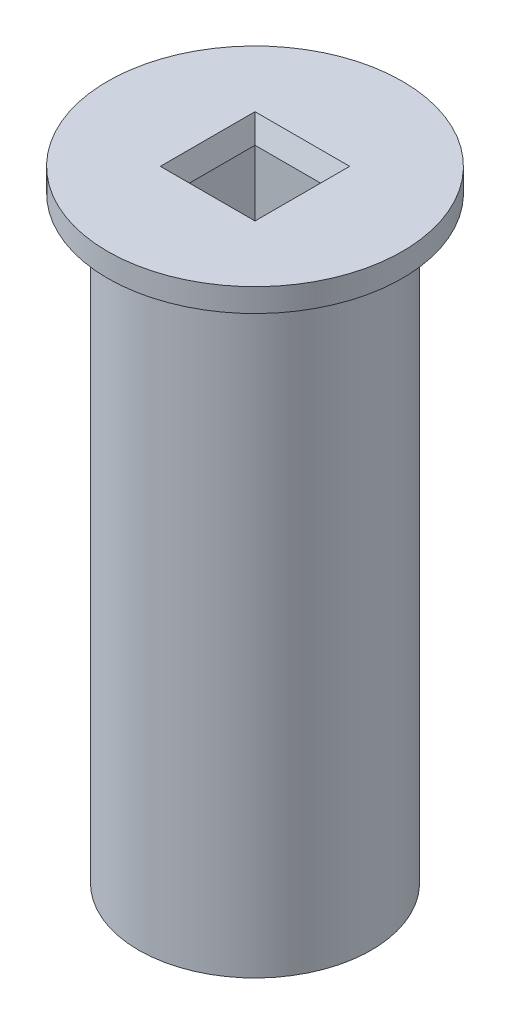
ISO-10303-21;
HEADER;
FILE_DESCRIPTION(('STEP AP214'),'2;1');
FILE_NAME('part.step','',(''),(''),'','','');
FILE_SCHEMA(('AUTOMOTIVE_DESIGN { 1 0 10303 214 1 1 1 1 }'));
ENDSEC;
DATA;
#1=APPLICATION_CONTEXT('core data for automotive mechanical design processes');
#2=APPLICATION_PROTOCOL_DEFINITION('international standard','automotive_design',2000,#1);
#3=PRODUCT_CONTEXT('',#1,'mechanical');
#4=PRODUCT('Part','Part','',(#3));
#5=PRODUCT_RELATED_PRODUCT_CATEGORY('part','',(#4));
#6=PRODUCT_DEFINITION_FORMATION('','',#4);
#7=PRODUCT_DEFINITION_CONTEXT('part definition',#1,'design');
#8=PRODUCT_DEFINITION('design','',#6,#7);
#9=PRODUCT_DEFINITION_SHAPE('','',#8);
#10=(LENGTH_UNIT() NAMED_UNIT(*) SI_UNIT(.MILLI.,.METRE.));
#11=(NAMED_UNIT(*) PLANE_ANGLE_UNIT() SI_UNIT($,.RADIAN.));
#12=(NAMED_UNIT(*) SI_UNIT($,.STERADIAN.) SOLID_ANGLE_UNIT());
#13=UNCERTAINTY_MEASURE_WITH_UNIT(LENGTH_MEASURE(1.E-05),#10,'distance_accuracy_value','');
#14=(GEOMETRIC_REPRESENTATION_CONTEXT(3) GLOBAL_UNCERTAINTY_ASSIGNED_CONTEXT((#13)) GLOBAL_UNIT_ASSIGNED_CONTEXT((#10,
#11,#12)) REPRESENTATION_CONTEXT('',''));
#15=CARTESIAN_POINT('',(0.,0.,0.));
#16=DIRECTION('',(0.,0.,1.));
#17=DIRECTION('',(1.,0.,0.));
#18=AXIS2_PLACEMENT_3D('',#15,#16,#17);
#19=CARTESIAN_POINT('',(0.,80.,0.));
#20=DIRECTION('',(0.,-1.,0.));
#21=DIRECTION('',(0.,0.,-1.));
#22=AXIS2_PLACEMENT_3D('',#19,#20,#21);
#23=CYLINDRICAL_SURFACE('',#22,15.);
#24=CARTESIAN_POINT('',(0.,0.,0.));
#25=DIRECTION('',(0.,1.,0.));
#26=DIRECTION('',(0.,0.,1.));
#27=AXIS2_PLACEMENT_3D('',#24,#25,#26);
#28=CIRCLE('',#27,15.);
#29=CARTESIAN_POINT('',(0.,0.,15.));
#30=VERTEX_POINT('',#29);
#31=EDGE_CURVE('E92',#30,#30,#28,.T.);
#32=ORIENTED_EDGE('',*,*,#31,.T.);
#33=EDGE_LOOP('',(#32));
#34=FACE_BOUND('',#33,.T.);
#35=CARTESIAN_POINT('',(0.,77.,0.));
#36=DIRECTION('',(0.,1.,0.));
#37=DIRECTION('',(0.,0.,1.));
#38=AXIS2_PLACEMENT_3D('',#35,#36,#37);
#39=CIRCLE('',#38,15.);
#40=CARTESIAN_POINT('',(0.,77.,15.));
#41=VERTEX_POINT('',#40);
#42=EDGE_CURVE('E113',#41,#41,#39,.T.);
#43=ORIENTED_EDGE('',*,*,#42,.F.);
#44=EDGE_LOOP('',(#43));
#45=FACE_BOUND('',#44,.T.);
#46=ADVANCED_FACE('F33',(#34,#45),#23,.T.);
#47=CARTESIAN_POINT('',(0.,80.,0.));
#48=DIRECTION('',(0.,1.,0.));
#49=DIRECTION('',(0.,0.,1.));
#50=AXIS2_PLACEMENT_3D('',#47,#48,#49);
#51=PLANE('',#50);
#52=DIRECTION('',(1.,0.,0.));
#53=VECTOR('',#52,1.);
#54=CARTESIAN_POINT('',(0.,80.,-6.1));
#55=LINE('',#54,#53);
#56=CARTESIAN_POINT('',(-6.1,80.,-6.1));
#57=VERTEX_POINT('',#56);
#58=CARTESIAN_POINT('',(6.1,80.,-6.1));
#59=VERTEX_POINT('',#58);
#60=EDGE_CURVE('E128',#57,#59,#55,.T.);
#61=ORIENTED_EDGE('',*,*,#60,.T.);
#62=DIRECTION('',(0.,0.,1.));
#63=VECTOR('',#62,1.);
#64=CARTESIAN_POINT('',(6.1,80.,0.));
#65=LINE('',#64,#63);
#66=CARTESIAN_POINT('',(6.1,80.,6.1));
#67=VERTEX_POINT('',#66);
#68=EDGE_CURVE('E134',#59,#67,#65,.T.);
#69=ORIENTED_EDGE('',*,*,#68,.T.);
#70=DIRECTION('',(-1.,0.,0.));
#71=VECTOR('',#70,1.);
#72=CARTESIAN_POINT('',(0.,80.,6.1));
#73=LINE('',#72,#71);
#74=CARTESIAN_POINT('',(-6.1,80.,6.1));
#75=VERTEX_POINT('',#74);
#76=EDGE_CURVE('E132',#67,#75,#73,.T.);
#77=ORIENTED_EDGE('',*,*,#76,.T.);
#78=DIRECTION('',(0.,0.,-1.));
#79=VECTOR('',#78,1.);
#80=CARTESIAN_POINT('',(-6.1,80.,0.));
#81=LINE('',#80,#79);
#82=EDGE_CURVE('E130',#75,#57,#81,.T.);
#83=ORIENTED_EDGE('',*,*,#82,.T.);
#84=EDGE_LOOP('',(#61,#69,#77,#83));
#85=FACE_BOUND('',#84,.T.);
#86=CARTESIAN_POINT('',(0.,80.,0.));
#87=DIRECTION('',(0.,1.,0.));
#88=DIRECTION('',(0.,0.,1.));
#89=AXIS2_PLACEMENT_3D('',#86,#87,#88);
#90=CIRCLE('',#89,19.);
#91=CARTESIAN_POINT('',(0.,80.,19.));
#92=VERTEX_POINT('',#91);
#93=EDGE_CURVE('E110',#92,#92,#90,.T.);
#94=ORIENTED_EDGE('',*,*,#93,.T.);
#95=EDGE_LOOP('',(#94));
#96=FACE_BOUND('',#95,.T.);
#97=ADVANCED_FACE('F155',(#85,#96),#51,.T.);
#98=CARTESIAN_POINT('',(0.,0.,0.));
#99=DIRECTION('',(0.,1.,0.));
#100=DIRECTION('',(0.,0.,1.));
#101=AXIS2_PLACEMENT_3D('',#98,#99,#100);
#102=PLANE('',#101);
#103=ORIENTED_EDGE('',*,*,#31,.F.);
#104=EDGE_LOOP('',(#103));
#105=FACE_BOUND('',#104,.T.);
#106=DIRECTION('',(0.,0.,1.));
#107=VECTOR('',#106,1.);
#108=CARTESIAN_POINT('',(-5.1,0.,5.1));
#109=LINE('',#108,#107);
#110=CARTESIAN_POINT('',(-5.1,0.,-5.1));
#111=VERTEX_POINT('',#110);
#112=CARTESIAN_POINT('',(-5.1,0.,5.1));
#113=VERTEX_POINT('',#112);
#114=EDGE_CURVE('E88',#111,#113,#109,.T.);
#115=ORIENTED_EDGE('',*,*,#114,.T.);
#116=DIRECTION('',(1.,0.,0.));
#117=VECTOR('',#116,1.);
#118=CARTESIAN_POINT('',(5.1,0.,5.1));
#119=LINE('',#118,#117);
#120=CARTESIAN_POINT('',(5.1,0.,5.1));
#121=VERTEX_POINT('',#120);
#122=EDGE_CURVE('E96',#113,#121,#119,.T.);
#123=ORIENTED_EDGE('',*,*,#122,.T.);
#124=DIRECTION('',(0.,0.,-1.));
#125=VECTOR('',#124,1.);
#126=CARTESIAN_POINT('',(5.1,0.,5.1));
#127=LINE('',#126,#125);
#128=CARTESIAN_POINT('',(5.1,0.,-5.1));
#129=VERTEX_POINT('',#128);
#130=EDGE_CURVE('E102',#121,#129,#127,.T.);
#131=ORIENTED_EDGE('',*,*,#130,.T.);
#132=DIRECTION('',(-1.,0.,0.));
#133=VECTOR('',#132,1.);
#134=CARTESIAN_POINT('',(5.1,0.,-5.1));
#135=LINE('',#134,#133);
#136=EDGE_CURVE('E106',#129,#111,#135,.T.);
#137=ORIENTED_EDGE('',*,*,#136,.T.);
#138=EDGE_LOOP('',(#115,#123,#131,#137));
#139=FACE_BOUND('',#138,.T.);
#140=ADVANCED_FACE('F104',(#105,#139),#102,.F.);
#141=CARTESIAN_POINT('',(-5.1,80.,5.1));
#142=DIRECTION('',(1.,0.,0.));
#143=DIRECTION('',(0.,0.,-1.));
#144=AXIS2_PLACEMENT_3D('',#141,#142,#143);
#145=PLANE('',#144);
#146=DIRECTION('',(0.,-1.,0.));
#147=VECTOR('',#146,1.);
#148=CARTESIAN_POINT('',(-5.1,80.,-5.1));
#149=LINE('',#148,#147);
#150=CARTESIAN_POINT('',(-5.1,77.2525225805453,-5.1));
#151=VERTEX_POINT('',#150);
#152=EDGE_CURVE('E118',#151,#111,#149,.T.);
#153=ORIENTED_EDGE('',*,*,#152,.F.);
#154=DIRECTION('',(0.,0.,1.));
#155=VECTOR('',#154,1.);
#156=CARTESIAN_POINT('',(-5.1,77.2525225805453,5.1));
#157=LINE('',#156,#155);
#158=CARTESIAN_POINT('',(-5.1,77.2525225805453,5.1));
#159=VERTEX_POINT('',#158);
#160=EDGE_CURVE('E42',#151,#159,#157,.T.);
#161=ORIENTED_EDGE('',*,*,#160,.T.);
#162=DIRECTION('',(0.,-1.,0.));
#163=VECTOR('',#162,1.);
#164=CARTESIAN_POINT('',(-5.1,80.,5.1));
#165=LINE('',#164,#163);
#166=EDGE_CURVE('E84',#159,#113,#165,.T.);
#167=ORIENTED_EDGE('',*,*,#166,.T.);
#168=ORIENTED_EDGE('',*,*,#114,.F.);
#169=EDGE_LOOP('',(#153,#161,#167,#168));
#170=FACE_BOUND('',#169,.T.);
#171=ADVANCED_FACE('F86',(#170),#145,.T.);
#172=CARTESIAN_POINT('',(5.1,80.,5.1));
#173=DIRECTION('',(0.,0.,-1.));
#174=DIRECTION('',(-1.,0.,0.));
#175=AXIS2_PLACEMENT_3D('',#172,#173,#174);
#176=PLANE('',#175);
#177=ORIENTED_EDGE('',*,*,#166,.F.);
#178=DIRECTION('',(1.,0.,0.));
#179=VECTOR('',#178,1.);
#180=CARTESIAN_POINT('',(5.1,77.2525225805453,5.1));
#181=LINE('',#180,#179);
#182=CARTESIAN_POINT('',(5.1,77.2525225805453,5.1));
#183=VERTEX_POINT('',#182);
#184=EDGE_CURVE('E137',#159,#183,#181,.T.);
#185=ORIENTED_EDGE('',*,*,#184,.T.);
#186=DIRECTION('',(0.,-1.,0.));
#187=VECTOR('',#186,1.);
#188=CARTESIAN_POINT('',(5.1,80.,5.1));
#189=LINE('',#188,#187);
#190=EDGE_CURVE('E93',#183,#121,#189,.T.);
#191=ORIENTED_EDGE('',*,*,#190,.T.);
#192=ORIENTED_EDGE('',*,*,#122,.F.);
#193=EDGE_LOOP('',(#177,#185,#191,#192));
#194=FACE_BOUND('',#193,.T.);
#195=ADVANCED_FACE('F97',(#194),#176,.T.);
#196=CARTESIAN_POINT('',(5.1,80.,5.1));
#197=DIRECTION('',(-1.,0.,0.));
#198=DIRECTION('',(0.,0.,1.));
#199=AXIS2_PLACEMENT_3D('',#196,#197,#198);
#200=PLANE('',#199);
#201=ORIENTED_EDGE('',*,*,#190,.F.);
#202=DIRECTION('',(0.,0.,-1.));
#203=VECTOR('',#202,1.);
#204=CARTESIAN_POINT('',(5.1,77.2525225805453,5.1));
#205=LINE('',#204,#203);
#206=CARTESIAN_POINT('',(5.1,77.2525225805453,-5.1));
#207=VERTEX_POINT('',#206);
#208=EDGE_CURVE('E125',#183,#207,#205,.T.);
#209=ORIENTED_EDGE('',*,*,#208,.T.);
#210=DIRECTION('',(0.,-1.,0.));
#211=VECTOR('',#210,1.);
#212=CARTESIAN_POINT('',(5.1,80.,-5.1));
#213=LINE('',#212,#211);
#214=EDGE_CURVE('E120',#207,#129,#213,.T.);
#215=ORIENTED_EDGE('',*,*,#214,.T.);
#216=ORIENTED_EDGE('',*,*,#130,.F.);
#217=EDGE_LOOP('',(#201,#209,#215,#216));
#218=FACE_BOUND('',#217,.T.);
#219=ADVANCED_FACE('F244',(#218),#200,.T.);
#220=CARTESIAN_POINT('',(5.1,80.,-5.1));
#221=DIRECTION('',(0.,0.,1.));
#222=DIRECTION('',(1.,0.,0.));
#223=AXIS2_PLACEMENT_3D('',#220,#221,#222);
#224=PLANE('',#223);
#225=ORIENTED_EDGE('',*,*,#214,.F.);
#226=DIRECTION('',(-1.,0.,0.));
#227=VECTOR('',#226,1.);
#228=CARTESIAN_POINT('',(5.1,77.2525225805453,-5.1));
#229=LINE('',#228,#227);
#230=EDGE_CURVE('E11',#207,#151,#229,.T.);
#231=ORIENTED_EDGE('',*,*,#230,.T.);
#232=ORIENTED_EDGE('',*,*,#152,.T.);
#233=ORIENTED_EDGE('',*,*,#136,.F.);
#234=EDGE_LOOP('',(#225,#231,#232,#233));
#235=FACE_BOUND('',#234,.T.);
#236=ADVANCED_FACE('F168',(#235),#224,.T.);
#237=CARTESIAN_POINT('',(0.,77.,0.));
#238=DIRECTION('',(0.,1.,0.));
#239=DIRECTION('',(0.,0.,1.));
#240=AXIS2_PLACEMENT_3D('',#237,#238,#239);
#241=PLANE('',#240);
#242=CARTESIAN_POINT('',(0.,77.,0.));
#243=DIRECTION('',(0.,1.,0.));
#244=DIRECTION('',(0.,0.,1.));
#245=AXIS2_PLACEMENT_3D('',#242,#243,#244);
#246=CIRCLE('',#245,19.);
#247=CARTESIAN_POINT('',(0.,77.,19.));
#248=VERTEX_POINT('',#247);
#249=EDGE_CURVE('E107',#248,#248,#246,.T.);
#250=ORIENTED_EDGE('',*,*,#249,.F.);
#251=EDGE_LOOP('',(#250));
#252=FACE_BOUND('',#251,.T.);
#253=ORIENTED_EDGE('',*,*,#42,.T.);
#254=EDGE_LOOP('',(#253));
#255=FACE_BOUND('',#254,.T.);
#256=ADVANCED_FACE('F159',(#252,#255),#241,.F.);
#257=CARTESIAN_POINT('',(0.,77.,0.));
#258=DIRECTION('',(0.,1.,0.));
#259=DIRECTION('',(0.,0.,1.));
#260=AXIS2_PLACEMENT_3D('',#257,#258,#259);
#261=CYLINDRICAL_SURFACE('',#260,19.);
#262=ORIENTED_EDGE('',*,*,#249,.T.);
#263=EDGE_LOOP('',(#262));
#264=FACE_BOUND('',#263,.T.);
#265=ORIENTED_EDGE('',*,*,#93,.F.);
#266=EDGE_LOOP('',(#265));
#267=FACE_BOUND('',#266,.T.);
#268=ADVANCED_FACE('F157',(#264,#267),#261,.T.);
#269=CARTESIAN_POINT('',(-5.1,77.2525225805453,5.1));
#270=DIRECTION('',(-0.939692620785909,-0.342020143325666,0.));
#271=DIRECTION('',(0.,0.,1.));
#272=AXIS2_PLACEMENT_3D('',#269,#270,#271);
#273=PLANE('',#272);
#274=DIRECTION('',(0.323615577118182,-0.88912649071599,0.323615577118182));
#275=VECTOR('',#274,1.);
#276=CARTESIAN_POINT('',(-4.03178417411395,74.3176237198193,-4.03178417411395));
#277=LINE('',#276,#275);
#278=EDGE_CURVE('E143',#57,#151,#277,.T.);
#279=ORIENTED_EDGE('',*,*,#278,.F.);
#280=ORIENTED_EDGE('',*,*,#82,.F.);
#281=DIRECTION('',(0.323615577118182,-0.88912649071599,-0.323615577118183));
#282=VECTOR('',#281,1.);
#283=CARTESIAN_POINT('',(-4.03178417411395,74.3176237198193,4.03178417411395));
#284=LINE('',#283,#282);
#285=EDGE_CURVE('E37',#159,#75,#284,.F.);
#286=ORIENTED_EDGE('',*,*,#285,.F.);
#287=ORIENTED_EDGE('',*,*,#160,.F.);
#288=EDGE_LOOP('',(#279,#280,#286,#287));
#289=FACE_BOUND('',#288,.T.);
#290=ADVANCED_FACE('F35',(#289),#273,.F.);
#291=CARTESIAN_POINT('',(5.1,77.2525225805453,5.1));
#292=DIRECTION('',(0.,-0.342020143325666,0.939692620785909));
#293=DIRECTION('',(1.,0.,0.));
#294=AXIS2_PLACEMENT_3D('',#291,#292,#293);
#295=PLANE('',#294);
#296=ORIENTED_EDGE('',*,*,#285,.T.);
#297=ORIENTED_EDGE('',*,*,#76,.F.);
#298=DIRECTION('',(-0.323615577118182,-0.88912649071599,-0.323615577118183));
#299=VECTOR('',#298,1.);
#300=CARTESIAN_POINT('',(5.1,77.2525225805453,5.1));
#301=LINE('',#300,#299);
#302=EDGE_CURVE('E142',#183,#67,#301,.F.);
#303=ORIENTED_EDGE('',*,*,#302,.F.);
#304=ORIENTED_EDGE('',*,*,#184,.F.);
#305=EDGE_LOOP('',(#296,#297,#303,#304));
#306=FACE_BOUND('',#305,.T.);
#307=ADVANCED_FACE('F166',(#306),#295,.F.);
#308=CARTESIAN_POINT('',(5.1,77.2525225805453,-5.1));
#309=DIRECTION('',(0.,-0.342020143325666,-0.93969262078591));
#310=DIRECTION('',(-1.,0.,0.));
#311=AXIS2_PLACEMENT_3D('',#308,#309,#310);
#312=PLANE('',#311);
#313=ORIENTED_EDGE('',*,*,#278,.T.);
#314=ORIENTED_EDGE('',*,*,#230,.F.);
#315=DIRECTION('',(0.323615577118182,0.88912649071599,-0.323615577118182));
#316=VECTOR('',#315,1.);
#317=CARTESIAN_POINT('',(4.03178417411395,74.3176237198193,-4.03178417411395));
#318=LINE('',#317,#316);
#319=EDGE_CURVE('E140',#59,#207,#318,.F.);
#320=ORIENTED_EDGE('',*,*,#319,.F.);
#321=ORIENTED_EDGE('',*,*,#60,.F.);
#322=EDGE_LOOP('',(#313,#314,#320,#321));
#323=FACE_BOUND('',#322,.T.);
#324=ADVANCED_FACE('F186',(#323),#312,.F.);
#325=CARTESIAN_POINT('',(5.1,77.2525225805453,5.1));
#326=DIRECTION('',(0.939692620785909,-0.342020143325666,0.));
#327=DIRECTION('',(0.,0.,-1.));
#328=AXIS2_PLACEMENT_3D('',#325,#326,#327);
#329=PLANE('',#328);
#330=ORIENTED_EDGE('',*,*,#302,.T.);
#331=ORIENTED_EDGE('',*,*,#68,.F.);
#332=ORIENTED_EDGE('',*,*,#319,.T.);
#333=ORIENTED_EDGE('',*,*,#208,.F.);
#334=EDGE_LOOP('',(#330,#331,#332,#333));
#335=FACE_BOUND('',#334,.T.);
#336=ADVANCED_FACE('F183',(#335),#329,.F.);
#337=CLOSED_SHELL('',(#46,#97,#140,#171,#195,#219,#236,#256,#268,#290,#307,#324,#336));
#338=MANIFOLD_SOLID_BREP('B2',#337);
#339=ADVANCED_BREP_SHAPE_REPRESENTATION('',(#18,#338),#14);
#340=SHAPE_DEFINITION_REPRESENTATION(#9,#339);
ENDSEC;
END-ISO-10303-21;
